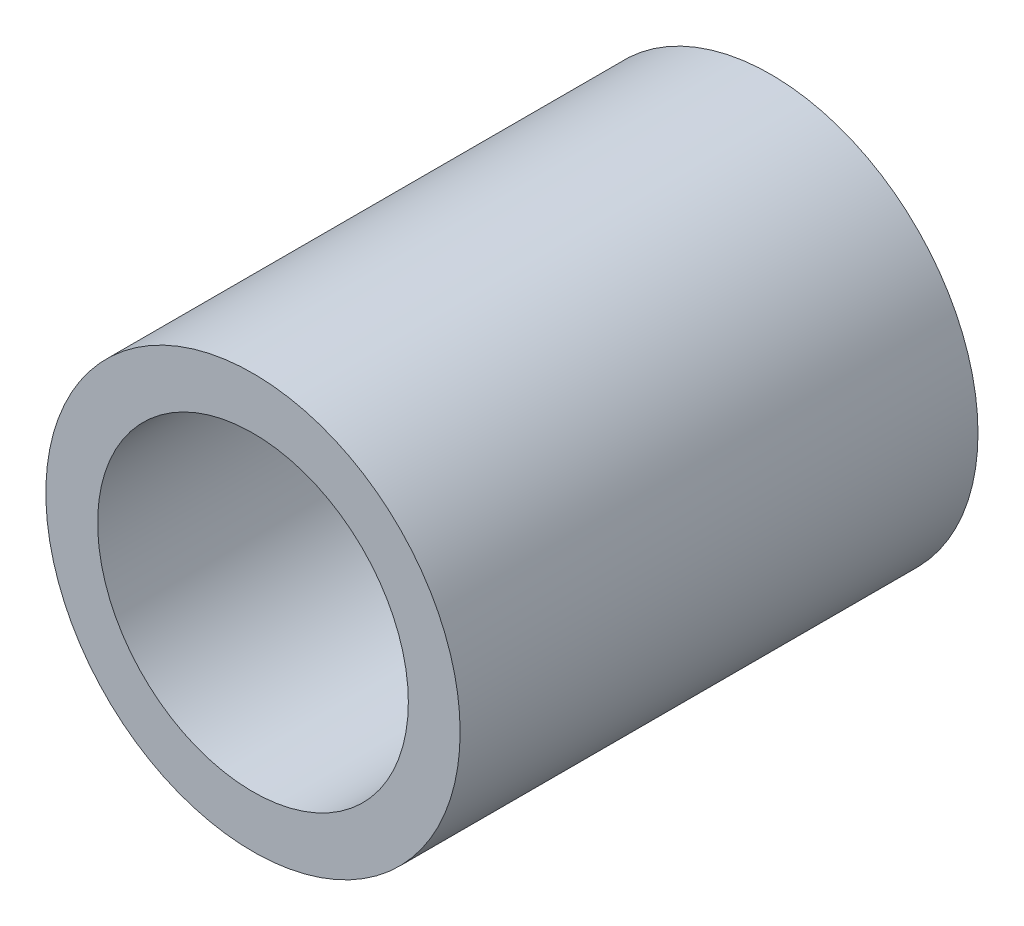
ISO-10303-21;
HEADER;
FILE_DESCRIPTION(('STEP AP214'),'2;1');
FILE_NAME('part.step','',(''),(''),'','','');
FILE_SCHEMA(('AUTOMOTIVE_DESIGN { 1 0 10303 214 1 1 1 1 }'));
ENDSEC;
DATA;
#1=APPLICATION_CONTEXT('core data for automotive mechanical design processes');
#2=APPLICATION_PROTOCOL_DEFINITION('international standard','automotive_design',2000,#1);
#3=PRODUCT_CONTEXT('',#1,'mechanical');
#4=PRODUCT('Part','Part','',(#3));
#5=PRODUCT_RELATED_PRODUCT_CATEGORY('part','',(#4));
#6=PRODUCT_DEFINITION_FORMATION('','',#4);
#7=PRODUCT_DEFINITION_CONTEXT('part definition',#1,'design');
#8=PRODUCT_DEFINITION('design','',#6,#7);
#9=PRODUCT_DEFINITION_SHAPE('','',#8);
#10=(LENGTH_UNIT() NAMED_UNIT(*) SI_UNIT(.MILLI.,.METRE.));
#11=(NAMED_UNIT(*) PLANE_ANGLE_UNIT() SI_UNIT($,.RADIAN.));
#12=(NAMED_UNIT(*) SI_UNIT($,.STERADIAN.) SOLID_ANGLE_UNIT());
#13=UNCERTAINTY_MEASURE_WITH_UNIT(LENGTH_MEASURE(1.E-05),#10,'distance_accuracy_value','');
#14=(GEOMETRIC_REPRESENTATION_CONTEXT(3) GLOBAL_UNCERTAINTY_ASSIGNED_CONTEXT((#13)) GLOBAL_UNIT_ASSIGNED_CONTEXT((#10,
#11,#12)) REPRESENTATION_CONTEXT('',''));
#15=CARTESIAN_POINT('',(0.,0.,0.));
#16=DIRECTION('',(0.,0.,1.));
#17=DIRECTION('',(1.,0.,0.));
#18=AXIS2_PLACEMENT_3D('',#15,#16,#17);
#19=CARTESIAN_POINT('',(0.,0.,10.));
#20=DIRECTION('',(0.,0.,1.));
#21=DIRECTION('',(1.,0.,0.));
#22=AXIS2_PLACEMENT_3D('',#19,#20,#21);
#23=PLANE('',#22);
#24=CARTESIAN_POINT('',(0.,0.,10.));
#25=DIRECTION('',(0.,0.,1.));
#26=DIRECTION('',(1.,0.,0.));
#27=AXIS2_PLACEMENT_3D('',#24,#25,#26);
#28=CIRCLE('',#27,4.);
#29=CARTESIAN_POINT('',(4.,0.,10.));
#30=VERTEX_POINT('',#29);
#31=EDGE_CURVE('E10',#30,#30,#28,.T.);
#32=ORIENTED_EDGE('',*,*,#31,.T.);
#33=EDGE_LOOP('',(#32));
#34=FACE_BOUND('',#33,.T.);
#35=CARTESIAN_POINT('',(0.,0.,10.));
#36=DIRECTION('',(0.,0.,1.));
#37=DIRECTION('',(1.,0.,0.));
#38=AXIS2_PLACEMENT_3D('',#35,#36,#37);
#39=CIRCLE('',#38,3.);
#40=CARTESIAN_POINT('',(3.,0.,10.));
#41=VERTEX_POINT('',#40);
#42=EDGE_CURVE('E56',#41,#41,#39,.T.);
#43=ORIENTED_EDGE('',*,*,#42,.F.);
#44=EDGE_LOOP('',(#43));
#45=FACE_BOUND('',#44,.T.);
#46=ADVANCED_FACE('F43',(#34,#45),#23,.T.);
#47=CARTESIAN_POINT('',(0.,0.,0.));
#48=DIRECTION('',(0.,0.,1.));
#49=DIRECTION('',(1.,0.,0.));
#50=AXIS2_PLACEMENT_3D('',#47,#48,#49);
#51=PLANE('',#50);
#52=CARTESIAN_POINT('',(0.,0.,0.));
#53=DIRECTION('',(0.,0.,1.));
#54=DIRECTION('',(1.,0.,0.));
#55=AXIS2_PLACEMENT_3D('',#52,#53,#54);
#56=CIRCLE('',#55,4.);
#57=CARTESIAN_POINT('',(4.,0.,0.));
#58=VERTEX_POINT('',#57);
#59=EDGE_CURVE('E47',#58,#58,#56,.T.);
#60=ORIENTED_EDGE('',*,*,#59,.F.);
#61=EDGE_LOOP('',(#60));
#62=FACE_BOUND('',#61,.T.);
#63=CARTESIAN_POINT('',(0.,0.,0.));
#64=DIRECTION('',(0.,0.,1.));
#65=DIRECTION('',(1.,0.,0.));
#66=AXIS2_PLACEMENT_3D('',#63,#64,#65);
#67=CIRCLE('',#66,3.);
#68=CARTESIAN_POINT('',(3.,0.,0.));
#69=VERTEX_POINT('',#68);
#70=EDGE_CURVE('E58',#69,#69,#67,.T.);
#71=ORIENTED_EDGE('',*,*,#70,.T.);
#72=EDGE_LOOP('',(#71));
#73=FACE_BOUND('',#72,.T.);
#74=ADVANCED_FACE('F70',(#62,#73),#51,.F.);
#75=CARTESIAN_POINT('',(0.,0.,10.));
#76=DIRECTION('',(0.,0.,-1.));
#77=DIRECTION('',(-1.,0.,0.));
#78=AXIS2_PLACEMENT_3D('',#75,#76,#77);
#79=CYLINDRICAL_SURFACE('',#78,4.);
#80=ORIENTED_EDGE('',*,*,#31,.F.);
#81=EDGE_LOOP('',(#80));
#82=FACE_BOUND('',#81,.T.);
#83=ORIENTED_EDGE('',*,*,#59,.T.);
#84=EDGE_LOOP('',(#83));
#85=FACE_BOUND('',#84,.T.);
#86=ADVANCED_FACE('F45',(#82,#85),#79,.T.);
#87=CARTESIAN_POINT('',(0.,0.,10.));
#88=DIRECTION('',(0.,0.,-1.));
#89=DIRECTION('',(-1.,0.,0.));
#90=AXIS2_PLACEMENT_3D('',#87,#88,#89);
#91=CYLINDRICAL_SURFACE('',#90,3.);
#92=ORIENTED_EDGE('',*,*,#42,.T.);
#93=EDGE_LOOP('',(#92));
#94=FACE_BOUND('',#93,.T.);
#95=ORIENTED_EDGE('',*,*,#70,.F.);
#96=EDGE_LOOP('',(#95));
#97=FACE_BOUND('',#96,.T.);
#98=ADVANCED_FACE('F66',(#94,#97),#91,.F.);
#99=CLOSED_SHELL('',(#46,#74,#86,#98));
#100=MANIFOLD_SOLID_BREP('B2',#99);
#101=ADVANCED_BREP_SHAPE_REPRESENTATION('',(#18,#100),#14);
#102=SHAPE_DEFINITION_REPRESENTATION(#9,#101);
ENDSEC;
END-ISO-10303-21;
